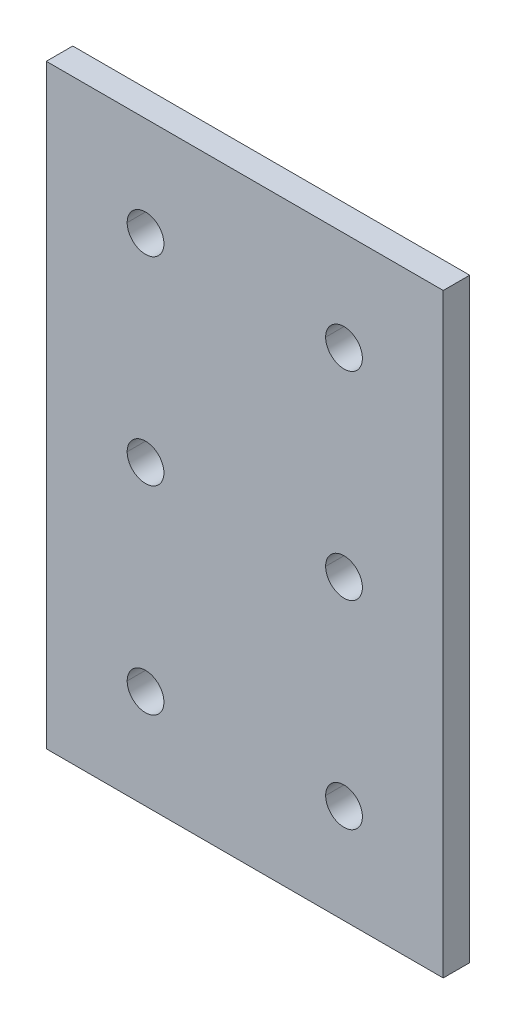
ISO-10303-21;
HEADER;
FILE_DESCRIPTION(('STEP AP214'),'2;1');
FILE_NAME('part.step','',(''),(''),'','','');
FILE_SCHEMA(('AUTOMOTIVE_DESIGN { 1 0 10303 214 1 1 1 1 }'));
ENDSEC;
DATA;
#1=APPLICATION_CONTEXT('core data for automotive mechanical design processes');
#2=APPLICATION_PROTOCOL_DEFINITION('international standard','automotive_design',2000,#1);
#3=PRODUCT_CONTEXT('',#1,'mechanical');
#4=PRODUCT('Part','Part','',(#3));
#5=PRODUCT_RELATED_PRODUCT_CATEGORY('part','',(#4));
#6=PRODUCT_DEFINITION_FORMATION('','',#4);
#7=PRODUCT_DEFINITION_CONTEXT('part definition',#1,'design');
#8=PRODUCT_DEFINITION('design','',#6,#7);
#9=PRODUCT_DEFINITION_SHAPE('','',#8);
#10=(LENGTH_UNIT() NAMED_UNIT(*) SI_UNIT(.MILLI.,.METRE.));
#11=(NAMED_UNIT(*) PLANE_ANGLE_UNIT() SI_UNIT($,.RADIAN.));
#12=(NAMED_UNIT(*) SI_UNIT($,.STERADIAN.) SOLID_ANGLE_UNIT());
#13=UNCERTAINTY_MEASURE_WITH_UNIT(LENGTH_MEASURE(1.E-05),#10,'distance_accuracy_value','');
#14=(GEOMETRIC_REPRESENTATION_CONTEXT(3) GLOBAL_UNCERTAINTY_ASSIGNED_CONTEXT((#13)) GLOBAL_UNIT_ASSIGNED_CONTEXT((#10,
#11,#12)) REPRESENTATION_CONTEXT('',''));
#15=CARTESIAN_POINT('',(0.,0.,0.));
#16=DIRECTION('',(0.,0.,1.));
#17=DIRECTION('',(1.,0.,0.));
#18=AXIS2_PLACEMENT_3D('',#15,#16,#17);
#19=CARTESIAN_POINT('',(45.,135.,6.));
#20=DIRECTION('',(0.,-1.,0.));
#21=DIRECTION('',(0.,0.,-1.));
#22=AXIS2_PLACEMENT_3D('',#19,#20,#21);
#23=PLANE('',#22);
#24=DIRECTION('',(-1.,0.,0.));
#25=VECTOR('',#24,1.);
#26=CARTESIAN_POINT('',(45.,135.,0.));
#27=LINE('',#26,#25);
#28=CARTESIAN_POINT('',(45.,135.,0.));
#29=VERTEX_POINT('',#28);
#30=CARTESIAN_POINT('',(-45.,135.,0.));
#31=VERTEX_POINT('',#30);
#32=EDGE_CURVE('E11',#29,#31,#27,.T.);
#33=ORIENTED_EDGE('',*,*,#32,.T.);
#34=DIRECTION('',(0.,0.,-1.));
#35=VECTOR('',#34,1.);
#36=CARTESIAN_POINT('',(-45.,135.,6.));
#37=LINE('',#36,#35);
#38=CARTESIAN_POINT('',(-45.,135.,6.));
#39=VERTEX_POINT('',#38);
#40=EDGE_CURVE('E25',#39,#31,#37,.T.);
#41=ORIENTED_EDGE('',*,*,#40,.F.);
#42=DIRECTION('',(-1.,0.,0.));
#43=VECTOR('',#42,1.);
#44=CARTESIAN_POINT('',(45.,135.,6.));
#45=LINE('',#44,#43);
#46=CARTESIAN_POINT('',(45.,135.,6.));
#47=VERTEX_POINT('',#46);
#48=EDGE_CURVE('E305',#47,#39,#45,.T.);
#49=ORIENTED_EDGE('',*,*,#48,.F.);
#50=DIRECTION('',(0.,0.,-1.));
#51=VECTOR('',#50,1.);
#52=CARTESIAN_POINT('',(45.,135.,6.));
#53=LINE('',#52,#51);
#54=EDGE_CURVE('E301',#47,#29,#53,.T.);
#55=ORIENTED_EDGE('',*,*,#54,.T.);
#56=EDGE_LOOP('',(#33,#41,#49,#55));
#57=FACE_BOUND('',#56,.T.);
#58=ADVANCED_FACE('F17',(#57),#23,.F.);
#59=CARTESIAN_POINT('',(45.,0.,6.));
#60=DIRECTION('',(-1.,0.,0.));
#61=DIRECTION('',(0.,0.,1.));
#62=AXIS2_PLACEMENT_3D('',#59,#60,#61);
#63=PLANE('',#62);
#64=DIRECTION('',(0.,1.,0.));
#65=VECTOR('',#64,1.);
#66=CARTESIAN_POINT('',(45.,0.,0.));
#67=LINE('',#66,#65);
#68=CARTESIAN_POINT('',(45.,0.,0.));
#69=VERTEX_POINT('',#68);
#70=EDGE_CURVE('E296',#69,#29,#67,.T.);
#71=ORIENTED_EDGE('',*,*,#70,.T.);
#72=ORIENTED_EDGE('',*,*,#54,.F.);
#73=DIRECTION('',(0.,1.,0.));
#74=VECTOR('',#73,1.);
#75=CARTESIAN_POINT('',(45.,0.,6.));
#76=LINE('',#75,#74);
#77=CARTESIAN_POINT('',(45.,0.,6.));
#78=VERTEX_POINT('',#77);
#79=EDGE_CURVE('E291',#78,#47,#76,.T.);
#80=ORIENTED_EDGE('',*,*,#79,.F.);
#81=DIRECTION('',(0.,0.,-1.));
#82=VECTOR('',#81,1.);
#83=CARTESIAN_POINT('',(45.,0.,6.));
#84=LINE('',#83,#82);
#85=EDGE_CURVE('E287',#78,#69,#84,.T.);
#86=ORIENTED_EDGE('',*,*,#85,.T.);
#87=EDGE_LOOP('',(#71,#72,#80,#86));
#88=FACE_BOUND('',#87,.T.);
#89=ADVANCED_FACE('F323',(#88),#63,.F.);
#90=CARTESIAN_POINT('',(-45.,0.,6.));
#91=DIRECTION('',(0.,1.,0.));
#92=DIRECTION('',(0.,0.,1.));
#93=AXIS2_PLACEMENT_3D('',#90,#91,#92);
#94=PLANE('',#93);
#95=DIRECTION('',(1.,0.,0.));
#96=VECTOR('',#95,1.);
#97=CARTESIAN_POINT('',(-45.,0.,0.));
#98=LINE('',#97,#96);
#99=CARTESIAN_POINT('',(-45.,0.,0.));
#100=VERTEX_POINT('',#99);
#101=EDGE_CURVE('E282',#100,#69,#98,.T.);
#102=ORIENTED_EDGE('',*,*,#101,.T.);
#103=ORIENTED_EDGE('',*,*,#85,.F.);
#104=DIRECTION('',(1.,0.,0.));
#105=VECTOR('',#104,1.);
#106=CARTESIAN_POINT('',(-45.,0.,6.));
#107=LINE('',#106,#105);
#108=CARTESIAN_POINT('',(-45.,0.,6.));
#109=VERTEX_POINT('',#108);
#110=EDGE_CURVE('E277',#109,#78,#107,.T.);
#111=ORIENTED_EDGE('',*,*,#110,.F.);
#112=DIRECTION('',(0.,0.,-1.));
#113=VECTOR('',#112,1.);
#114=CARTESIAN_POINT('',(-45.,0.,6.));
#115=LINE('',#114,#113);
#116=EDGE_CURVE('E273',#109,#100,#115,.T.);
#117=ORIENTED_EDGE('',*,*,#116,.T.);
#118=EDGE_LOOP('',(#102,#103,#111,#117));
#119=FACE_BOUND('',#118,.T.);
#120=ADVANCED_FACE('F327',(#119),#94,.F.);
#121=CARTESIAN_POINT('',(-45.,135.,6.));
#122=DIRECTION('',(1.,0.,0.));
#123=DIRECTION('',(0.,0.,-1.));
#124=AXIS2_PLACEMENT_3D('',#121,#122,#123);
#125=PLANE('',#124);
#126=DIRECTION('',(0.,-1.,0.));
#127=VECTOR('',#126,1.);
#128=CARTESIAN_POINT('',(-45.,135.,0.));
#129=LINE('',#128,#127);
#130=EDGE_CURVE('E268',#31,#100,#129,.T.);
#131=ORIENTED_EDGE('',*,*,#130,.T.);
#132=ORIENTED_EDGE('',*,*,#116,.F.);
#133=DIRECTION('',(0.,-1.,0.));
#134=VECTOR('',#133,1.);
#135=CARTESIAN_POINT('',(-45.,135.,6.));
#136=LINE('',#135,#134);
#137=EDGE_CURVE('E263',#39,#109,#136,.T.);
#138=ORIENTED_EDGE('',*,*,#137,.F.);
#139=ORIENTED_EDGE('',*,*,#40,.T.);
#140=EDGE_LOOP('',(#131,#132,#138,#139));
#141=FACE_BOUND('',#140,.T.);
#142=ADVANCED_FACE('F315',(#141),#125,.F.);
#143=CARTESIAN_POINT('',(0.,0.,6.));
#144=DIRECTION('',(0.,0.,1.));
#145=DIRECTION('',(1.,0.,0.));
#146=AXIS2_PLACEMENT_3D('',#143,#144,#145);
#147=PLANE('',#146);
#148=CARTESIAN_POINT('',(-22.5,112.5,6.));
#149=DIRECTION('',(0.,0.,1.));
#150=DIRECTION('',(1.,0.,0.));
#151=AXIS2_PLACEMENT_3D('',#148,#149,#150);
#152=CIRCLE('',#151,4.165);
#153=CARTESIAN_POINT('',(-26.665,112.5,6.));
#154=VERTEX_POINT('',#153);
#155=CARTESIAN_POINT('',(-18.335,112.5,6.));
#156=VERTEX_POINT('',#155);
#157=EDGE_CURVE('E258',#154,#156,#152,.T.);
#158=ORIENTED_EDGE('',*,*,#157,.F.);
#159=CARTESIAN_POINT('',(-22.5,112.5,6.));
#160=DIRECTION('',(0.,0.,1.));
#161=DIRECTION('',(1.,0.,0.));
#162=AXIS2_PLACEMENT_3D('',#159,#160,#161);
#163=CIRCLE('',#162,4.165);
#164=EDGE_CURVE('E253',#156,#154,#163,.T.);
#165=ORIENTED_EDGE('',*,*,#164,.F.);
#166=EDGE_LOOP('',(#158,#165));
#167=FACE_BOUND('',#166,.T.);
#168=CARTESIAN_POINT('',(-22.5,67.5,6.));
#169=DIRECTION('',(0.,0.,1.));
#170=DIRECTION('',(1.,0.,0.));
#171=AXIS2_PLACEMENT_3D('',#168,#169,#170);
#172=CIRCLE('',#171,4.165);
#173=CARTESIAN_POINT('',(-26.665,67.5,6.));
#174=VERTEX_POINT('',#173);
#175=CARTESIAN_POINT('',(-18.335,67.5,6.));
#176=VERTEX_POINT('',#175);
#177=EDGE_CURVE('E248',#174,#176,#172,.T.);
#178=ORIENTED_EDGE('',*,*,#177,.F.);
#179=CARTESIAN_POINT('',(-22.5,67.5,6.));
#180=DIRECTION('',(0.,0.,1.));
#181=DIRECTION('',(1.,0.,0.));
#182=AXIS2_PLACEMENT_3D('',#179,#180,#181);
#183=CIRCLE('',#182,4.165);
#184=EDGE_CURVE('E243',#176,#174,#183,.T.);
#185=ORIENTED_EDGE('',*,*,#184,.F.);
#186=EDGE_LOOP('',(#178,#185));
#187=FACE_BOUND('',#186,.T.);
#188=CARTESIAN_POINT('',(-22.5,22.5,6.));
#189=DIRECTION('',(0.,0.,1.));
#190=DIRECTION('',(1.,0.,0.));
#191=AXIS2_PLACEMENT_3D('',#188,#189,#190);
#192=CIRCLE('',#191,4.165);
#193=CARTESIAN_POINT('',(-26.665,22.5,6.));
#194=VERTEX_POINT('',#193);
#195=CARTESIAN_POINT('',(-18.335,22.5,6.));
#196=VERTEX_POINT('',#195);
#197=EDGE_CURVE('E238',#194,#196,#192,.T.);
#198=ORIENTED_EDGE('',*,*,#197,.F.);
#199=CARTESIAN_POINT('',(-22.5,22.5,6.));
#200=DIRECTION('',(0.,0.,1.));
#201=DIRECTION('',(1.,0.,0.));
#202=AXIS2_PLACEMENT_3D('',#199,#200,#201);
#203=CIRCLE('',#202,4.165);
#204=EDGE_CURVE('E233',#196,#194,#203,.T.);
#205=ORIENTED_EDGE('',*,*,#204,.F.);
#206=EDGE_LOOP('',(#198,#205));
#207=FACE_BOUND('',#206,.T.);
#208=CARTESIAN_POINT('',(22.5,112.5,6.));
#209=DIRECTION('',(0.,0.,1.));
#210=DIRECTION('',(1.,0.,0.));
#211=AXIS2_PLACEMENT_3D('',#208,#209,#210);
#212=CIRCLE('',#211,4.165);
#213=CARTESIAN_POINT('',(18.335,112.5,6.));
#214=VERTEX_POINT('',#213);
#215=CARTESIAN_POINT('',(26.665,112.5,6.));
#216=VERTEX_POINT('',#215);
#217=EDGE_CURVE('E228',#214,#216,#212,.T.);
#218=ORIENTED_EDGE('',*,*,#217,.F.);
#219=CARTESIAN_POINT('',(22.5,112.5,6.));
#220=DIRECTION('',(0.,0.,1.));
#221=DIRECTION('',(1.,0.,0.));
#222=AXIS2_PLACEMENT_3D('',#219,#220,#221);
#223=CIRCLE('',#222,4.165);
#224=EDGE_CURVE('E223',#216,#214,#223,.T.);
#225=ORIENTED_EDGE('',*,*,#224,.F.);
#226=EDGE_LOOP('',(#218,#225));
#227=FACE_BOUND('',#226,.T.);
#228=CARTESIAN_POINT('',(22.5,67.5,6.));
#229=DIRECTION('',(0.,0.,1.));
#230=DIRECTION('',(1.,0.,0.));
#231=AXIS2_PLACEMENT_3D('',#228,#229,#230);
#232=CIRCLE('',#231,4.165);
#233=CARTESIAN_POINT('',(18.335,67.5,6.));
#234=VERTEX_POINT('',#233);
#235=CARTESIAN_POINT('',(26.665,67.5,6.));
#236=VERTEX_POINT('',#235);
#237=EDGE_CURVE('E146',#234,#236,#232,.T.);
#238=ORIENTED_EDGE('',*,*,#237,.F.);
#239=CARTESIAN_POINT('',(22.5,67.5,6.));
#240=DIRECTION('',(0.,0.,1.));
#241=DIRECTION('',(1.,0.,0.));
#242=AXIS2_PLACEMENT_3D('',#239,#240,#241);
#243=CIRCLE('',#242,4.165);
#244=EDGE_CURVE('E216',#236,#234,#243,.T.);
#245=ORIENTED_EDGE('',*,*,#244,.F.);
#246=EDGE_LOOP('',(#238,#245));
#247=FACE_BOUND('',#246,.T.);
#248=CARTESIAN_POINT('',(22.5,22.5,6.));
#249=DIRECTION('',(0.,0.,1.));
#250=DIRECTION('',(1.,0.,0.));
#251=AXIS2_PLACEMENT_3D('',#248,#249,#250);
#252=CIRCLE('',#251,4.165);
#253=CARTESIAN_POINT('',(18.335,22.5,6.));
#254=VERTEX_POINT('',#253);
#255=CARTESIAN_POINT('',(26.665,22.5,6.));
#256=VERTEX_POINT('',#255);
#257=EDGE_CURVE('E211',#254,#256,#252,.T.);
#258=ORIENTED_EDGE('',*,*,#257,.F.);
#259=CARTESIAN_POINT('',(22.5,22.5,6.));
#260=DIRECTION('',(0.,0.,1.));
#261=DIRECTION('',(1.,0.,0.));
#262=AXIS2_PLACEMENT_3D('',#259,#260,#261);
#263=CIRCLE('',#262,4.165);
#264=EDGE_CURVE('E206',#256,#254,#263,.T.);
#265=ORIENTED_EDGE('',*,*,#264,.F.);
#266=EDGE_LOOP('',(#258,#265));
#267=FACE_BOUND('',#266,.T.);
#268=ORIENTED_EDGE('',*,*,#48,.T.);
#269=ORIENTED_EDGE('',*,*,#137,.T.);
#270=ORIENTED_EDGE('',*,*,#110,.T.);
#271=ORIENTED_EDGE('',*,*,#79,.T.);
#272=EDGE_LOOP('',(#268,#269,#270,#271));
#273=FACE_BOUND('',#272,.T.);
#274=ADVANCED_FACE('F319',(#167,#187,#207,#227,#247,#267,#273),#147,.T.);
#275=CARTESIAN_POINT('',(22.5,22.5,6.));
#276=DIRECTION('',(0.,0.,-1.));
#277=DIRECTION('',(0.,-1.,0.));
#278=AXIS2_PLACEMENT_3D('',#275,#276,#277);
#279=CYLINDRICAL_SURFACE('',#278,4.165);
#280=DIRECTION('',(0.,0.,-1.));
#281=VECTOR('',#280,1.);
#282=CARTESIAN_POINT('',(26.665,22.5,6.));
#283=LINE('',#282,#281);
#284=CARTESIAN_POINT('',(26.665,22.5,0.));
#285=VERTEX_POINT('',#284);
#286=EDGE_CURVE('E201',#256,#285,#283,.T.);
#287=ORIENTED_EDGE('',*,*,#286,.F.);
#288=ORIENTED_EDGE('',*,*,#264,.T.);
#289=DIRECTION('',(0.,0.,-1.));
#290=VECTOR('',#289,1.);
#291=CARTESIAN_POINT('',(18.335,22.5,6.));
#292=LINE('',#291,#290);
#293=CARTESIAN_POINT('',(18.335,22.5,0.));
#294=VERTEX_POINT('',#293);
#295=EDGE_CURVE('E197',#254,#294,#292,.T.);
#296=ORIENTED_EDGE('',*,*,#295,.T.);
#297=CARTESIAN_POINT('',(22.5,22.5,0.));
#298=DIRECTION('',(0.,0.,1.));
#299=DIRECTION('',(1.,0.,0.));
#300=AXIS2_PLACEMENT_3D('',#297,#298,#299);
#301=CIRCLE('',#300,4.165);
#302=EDGE_CURVE('E192',#285,#294,#301,.T.);
#303=ORIENTED_EDGE('',*,*,#302,.F.);
#304=EDGE_LOOP('',(#287,#288,#296,#303));
#305=FACE_BOUND('',#304,.T.);
#306=ADVANCED_FACE('F370',(#305),#279,.F.);
#307=CARTESIAN_POINT('',(0.,0.,0.));
#308=DIRECTION('',(0.,0.,1.));
#309=DIRECTION('',(1.,0.,0.));
#310=AXIS2_PLACEMENT_3D('',#307,#308,#309);
#311=PLANE('',#310);
#312=CARTESIAN_POINT('',(-22.5,112.5,0.));
#313=DIRECTION('',(0.,0.,1.));
#314=DIRECTION('',(1.,0.,0.));
#315=AXIS2_PLACEMENT_3D('',#312,#313,#314);
#316=CIRCLE('',#315,4.165);
#317=CARTESIAN_POINT('',(-18.335,112.5,0.));
#318=VERTEX_POINT('',#317);
#319=CARTESIAN_POINT('',(-26.665,112.5,0.));
#320=VERTEX_POINT('',#319);
#321=EDGE_CURVE('E188',#318,#320,#316,.T.);
#322=ORIENTED_EDGE('',*,*,#321,.T.);
#323=CARTESIAN_POINT('',(-22.5,112.5,0.));
#324=DIRECTION('',(0.,0.,1.));
#325=DIRECTION('',(1.,0.,0.));
#326=AXIS2_PLACEMENT_3D('',#323,#324,#325);
#327=CIRCLE('',#326,4.165);
#328=EDGE_CURVE('E184',#320,#318,#327,.T.);
#329=ORIENTED_EDGE('',*,*,#328,.T.);
#330=EDGE_LOOP('',(#322,#329));
#331=FACE_BOUND('',#330,.T.);
#332=CARTESIAN_POINT('',(-22.5,67.5,0.));
#333=DIRECTION('',(0.,0.,1.));
#334=DIRECTION('',(1.,0.,0.));
#335=AXIS2_PLACEMENT_3D('',#332,#333,#334);
#336=CIRCLE('',#335,4.165);
#337=CARTESIAN_POINT('',(-18.335,67.5,0.));
#338=VERTEX_POINT('',#337);
#339=CARTESIAN_POINT('',(-26.665,67.5,0.));
#340=VERTEX_POINT('',#339);
#341=EDGE_CURVE('E180',#338,#340,#336,.T.);
#342=ORIENTED_EDGE('',*,*,#341,.T.);
#343=CARTESIAN_POINT('',(-22.5,67.5,0.));
#344=DIRECTION('',(0.,0.,1.));
#345=DIRECTION('',(1.,0.,0.));
#346=AXIS2_PLACEMENT_3D('',#343,#344,#345);
#347=CIRCLE('',#346,4.165);
#348=EDGE_CURVE('E176',#340,#338,#347,.T.);
#349=ORIENTED_EDGE('',*,*,#348,.T.);
#350=EDGE_LOOP('',(#342,#349));
#351=FACE_BOUND('',#350,.T.);
#352=CARTESIAN_POINT('',(-22.5,22.5,0.));
#353=DIRECTION('',(0.,0.,1.));
#354=DIRECTION('',(1.,0.,0.));
#355=AXIS2_PLACEMENT_3D('',#352,#353,#354);
#356=CIRCLE('',#355,4.165);
#357=CARTESIAN_POINT('',(-18.335,22.5,0.));
#358=VERTEX_POINT('',#357);
#359=CARTESIAN_POINT('',(-26.665,22.5,0.));
#360=VERTEX_POINT('',#359);
#361=EDGE_CURVE('E172',#358,#360,#356,.T.);
#362=ORIENTED_EDGE('',*,*,#361,.T.);
#363=CARTESIAN_POINT('',(-22.5,22.5,0.));
#364=DIRECTION('',(0.,0.,1.));
#365=DIRECTION('',(1.,0.,0.));
#366=AXIS2_PLACEMENT_3D('',#363,#364,#365);
#367=CIRCLE('',#366,4.165);
#368=EDGE_CURVE('E168',#360,#358,#367,.T.);
#369=ORIENTED_EDGE('',*,*,#368,.T.);
#370=EDGE_LOOP('',(#362,#369));
#371=FACE_BOUND('',#370,.T.);
#372=CARTESIAN_POINT('',(22.5,112.5,0.));
#373=DIRECTION('',(0.,0.,1.));
#374=DIRECTION('',(1.,0.,0.));
#375=AXIS2_PLACEMENT_3D('',#372,#373,#374);
#376=CIRCLE('',#375,4.165);
#377=CARTESIAN_POINT('',(26.665,112.5,0.));
#378=VERTEX_POINT('',#377);
#379=CARTESIAN_POINT('',(18.335,112.5,0.));
#380=VERTEX_POINT('',#379);
#381=EDGE_CURVE('E164',#378,#380,#376,.T.);
#382=ORIENTED_EDGE('',*,*,#381,.T.);
#383=CARTESIAN_POINT('',(22.5,112.5,0.));
#384=DIRECTION('',(0.,0.,1.));
#385=DIRECTION('',(1.,0.,0.));
#386=AXIS2_PLACEMENT_3D('',#383,#384,#385);
#387=CIRCLE('',#386,4.165);
#388=EDGE_CURVE('E143',#380,#378,#387,.T.);
#389=ORIENTED_EDGE('',*,*,#388,.T.);
#390=EDGE_LOOP('',(#382,#389));
#391=FACE_BOUND('',#390,.T.);
#392=CARTESIAN_POINT('',(22.5,67.5,0.));
#393=DIRECTION('',(0.,0.,1.));
#394=DIRECTION('',(1.,0.,0.));
#395=AXIS2_PLACEMENT_3D('',#392,#393,#394);
#396=CIRCLE('',#395,4.165);
#397=CARTESIAN_POINT('',(26.665,67.5,0.));
#398=VERTEX_POINT('',#397);
#399=CARTESIAN_POINT('',(18.335,67.5,0.));
#400=VERTEX_POINT('',#399);
#401=EDGE_CURVE('E129',#398,#400,#396,.T.);
#402=ORIENTED_EDGE('',*,*,#401,.T.);
#403=CARTESIAN_POINT('',(22.5,67.5,0.));
#404=DIRECTION('',(0.,0.,1.));
#405=DIRECTION('',(1.,0.,0.));
#406=AXIS2_PLACEMENT_3D('',#403,#404,#405);
#407=CIRCLE('',#406,4.165);
#408=EDGE_CURVE('E125',#400,#398,#407,.T.);
#409=ORIENTED_EDGE('',*,*,#408,.T.);
#410=EDGE_LOOP('',(#402,#409));
#411=FACE_BOUND('',#410,.T.);
#412=ORIENTED_EDGE('',*,*,#302,.T.);
#413=CARTESIAN_POINT('',(22.5,22.5,0.));
#414=DIRECTION('',(0.,0.,1.));
#415=DIRECTION('',(1.,0.,0.));
#416=AXIS2_PLACEMENT_3D('',#413,#414,#415);
#417=CIRCLE('',#416,4.165);
#418=EDGE_CURVE('E134',#294,#285,#417,.T.);
#419=ORIENTED_EDGE('',*,*,#418,.T.);
#420=EDGE_LOOP('',(#412,#419));
#421=FACE_BOUND('',#420,.T.);
#422=ORIENTED_EDGE('',*,*,#32,.F.);
#423=ORIENTED_EDGE('',*,*,#70,.F.);
#424=ORIENTED_EDGE('',*,*,#101,.F.);
#425=ORIENTED_EDGE('',*,*,#130,.F.);
#426=EDGE_LOOP('',(#422,#423,#424,#425));
#427=FACE_BOUND('',#426,.T.);
#428=ADVANCED_FACE('F127',(#331,#351,#371,#391,#411,#421,#427),#311,.F.);
#429=CARTESIAN_POINT('',(22.5,22.5,6.));
#430=DIRECTION('',(0.,0.,-1.));
#431=DIRECTION('',(0.,1.,0.));
#432=AXIS2_PLACEMENT_3D('',#429,#430,#431);
#433=CYLINDRICAL_SURFACE('',#432,4.165);
#434=ORIENTED_EDGE('',*,*,#286,.T.);
#435=ORIENTED_EDGE('',*,*,#418,.F.);
#436=ORIENTED_EDGE('',*,*,#295,.F.);
#437=ORIENTED_EDGE('',*,*,#257,.T.);
#438=EDGE_LOOP('',(#434,#435,#436,#437));
#439=FACE_BOUND('',#438,.T.);
#440=ADVANCED_FACE('F391',(#439),#433,.F.);
#441=CARTESIAN_POINT('',(22.5,67.5,6.));
#442=DIRECTION('',(0.,0.,-1.));
#443=DIRECTION('',(0.,1.,0.));
#444=AXIS2_PLACEMENT_3D('',#441,#442,#443);
#445=CYLINDRICAL_SURFACE('',#444,4.165);
#446=DIRECTION('',(0.,0.,-1.));
#447=VECTOR('',#446,1.);
#448=CARTESIAN_POINT('',(26.665,67.5,6.));
#449=LINE('',#448,#447);
#450=EDGE_CURVE('E140',#236,#398,#449,.T.);
#451=ORIENTED_EDGE('',*,*,#450,.T.);
#452=ORIENTED_EDGE('',*,*,#408,.F.);
#453=DIRECTION('',(0.,0.,-1.));
#454=VECTOR('',#453,1.);
#455=CARTESIAN_POINT('',(18.335,67.5,6.));
#456=LINE('',#455,#454);
#457=EDGE_CURVE('E142',#234,#400,#456,.T.);
#458=ORIENTED_EDGE('',*,*,#457,.F.);
#459=ORIENTED_EDGE('',*,*,#237,.T.);
#460=EDGE_LOOP('',(#451,#452,#458,#459));
#461=FACE_BOUND('',#460,.T.);
#462=ADVANCED_FACE('F145',(#461),#445,.F.);
#463=CARTESIAN_POINT('',(22.5,67.5,6.));
#464=DIRECTION('',(0.,0.,-1.));
#465=DIRECTION('',(0.,-1.,0.));
#466=AXIS2_PLACEMENT_3D('',#463,#464,#465);
#467=CYLINDRICAL_SURFACE('',#466,4.165);
#468=ORIENTED_EDGE('',*,*,#450,.F.);
#469=ORIENTED_EDGE('',*,*,#244,.T.);
#470=ORIENTED_EDGE('',*,*,#457,.T.);
#471=ORIENTED_EDGE('',*,*,#401,.F.);
#472=EDGE_LOOP('',(#468,#469,#470,#471));
#473=FACE_BOUND('',#472,.T.);
#474=ADVANCED_FACE('F138',(#473),#467,.F.);
#475=CARTESIAN_POINT('',(22.5,112.5,6.));
#476=DIRECTION('',(0.,0.,-1.));
#477=DIRECTION('',(0.,1.,0.));
#478=AXIS2_PLACEMENT_3D('',#475,#476,#477);
#479=CYLINDRICAL_SURFACE('',#478,4.165);
#480=DIRECTION('',(0.,0.,-1.));
#481=VECTOR('',#480,1.);
#482=CARTESIAN_POINT('',(26.665,112.5,6.));
#483=LINE('',#482,#481);
#484=EDGE_CURVE('E150',#216,#378,#483,.T.);
#485=ORIENTED_EDGE('',*,*,#484,.T.);
#486=ORIENTED_EDGE('',*,*,#388,.F.);
#487=DIRECTION('',(0.,0.,-1.));
#488=VECTOR('',#487,1.);
#489=CARTESIAN_POINT('',(18.335,112.5,6.));
#490=LINE('',#489,#488);
#491=EDGE_CURVE('E563',#214,#380,#490,.T.);
#492=ORIENTED_EDGE('',*,*,#491,.F.);
#493=ORIENTED_EDGE('',*,*,#217,.T.);
#494=EDGE_LOOP('',(#485,#486,#492,#493));
#495=FACE_BOUND('',#494,.T.);
#496=ADVANCED_FACE('F421',(#495),#479,.F.);
#497=CARTESIAN_POINT('',(22.5,112.5,6.));
#498=DIRECTION('',(0.,0.,-1.));
#499=DIRECTION('',(0.,-1.,0.));
#500=AXIS2_PLACEMENT_3D('',#497,#498,#499);
#501=CYLINDRICAL_SURFACE('',#500,4.165);
#502=ORIENTED_EDGE('',*,*,#484,.F.);
#503=ORIENTED_EDGE('',*,*,#224,.T.);
#504=ORIENTED_EDGE('',*,*,#491,.T.);
#505=ORIENTED_EDGE('',*,*,#381,.F.);
#506=EDGE_LOOP('',(#502,#503,#504,#505));
#507=FACE_BOUND('',#506,.T.);
#508=ADVANCED_FACE('F431',(#507),#501,.F.);
#509=CARTESIAN_POINT('',(-22.5,22.5,6.));
#510=DIRECTION('',(0.,0.,-1.));
#511=DIRECTION('',(0.,1.,0.));
#512=AXIS2_PLACEMENT_3D('',#509,#510,#511);
#513=CYLINDRICAL_SURFACE('',#512,4.165);
#514=DIRECTION('',(0.,0.,-1.));
#515=VECTOR('',#514,1.);
#516=CARTESIAN_POINT('',(-18.335,22.5,6.));
#517=LINE('',#516,#515);
#518=EDGE_CURVE('E565',#196,#358,#517,.T.);
#519=ORIENTED_EDGE('',*,*,#518,.T.);
#520=ORIENTED_EDGE('',*,*,#368,.F.);
#521=DIRECTION('',(0.,0.,-1.));
#522=VECTOR('',#521,1.);
#523=CARTESIAN_POINT('',(-26.665,22.5,6.));
#524=LINE('',#523,#522);
#525=EDGE_CURVE('E577',#194,#360,#524,.T.);
#526=ORIENTED_EDGE('',*,*,#525,.F.);
#527=ORIENTED_EDGE('',*,*,#197,.T.);
#528=EDGE_LOOP('',(#519,#520,#526,#527));
#529=FACE_BOUND('',#528,.T.);
#530=ADVANCED_FACE('F442',(#529),#513,.F.);
#531=CARTESIAN_POINT('',(-22.5,22.5,6.));
#532=DIRECTION('',(0.,0.,-1.));
#533=DIRECTION('',(0.,-1.,0.));
#534=AXIS2_PLACEMENT_3D('',#531,#532,#533);
#535=CYLINDRICAL_SURFACE('',#534,4.165);
#536=ORIENTED_EDGE('',*,*,#518,.F.);
#537=ORIENTED_EDGE('',*,*,#204,.T.);
#538=ORIENTED_EDGE('',*,*,#525,.T.);
#539=ORIENTED_EDGE('',*,*,#361,.F.);
#540=EDGE_LOOP('',(#536,#537,#538,#539));
#541=FACE_BOUND('',#540,.T.);
#542=ADVANCED_FACE('F453',(#541),#535,.F.);
#543=CARTESIAN_POINT('',(-22.5,67.5,6.));
#544=DIRECTION('',(0.,0.,-1.));
#545=DIRECTION('',(0.,1.,0.));
#546=AXIS2_PLACEMENT_3D('',#543,#544,#545);
#547=CYLINDRICAL_SURFACE('',#546,4.165);
#548=DIRECTION('',(0.,0.,-1.));
#549=VECTOR('',#548,1.);
#550=CARTESIAN_POINT('',(-18.335,67.5,6.));
#551=LINE('',#550,#549);
#552=EDGE_CURVE('E582',#176,#338,#551,.T.);
#553=ORIENTED_EDGE('',*,*,#552,.T.);
#554=ORIENTED_EDGE('',*,*,#348,.F.);
#555=DIRECTION('',(0.,0.,-1.));
#556=VECTOR('',#555,1.);
#557=CARTESIAN_POINT('',(-26.665,67.5,6.));
#558=LINE('',#557,#556);
#559=EDGE_CURVE('E544',#174,#340,#558,.T.);
#560=ORIENTED_EDGE('',*,*,#559,.F.);
#561=ORIENTED_EDGE('',*,*,#177,.T.);
#562=EDGE_LOOP('',(#553,#554,#560,#561));
#563=FACE_BOUND('',#562,.T.);
#564=ADVANCED_FACE('F464',(#563),#547,.F.);
#565=CARTESIAN_POINT('',(-22.5,67.5,6.));
#566=DIRECTION('',(0.,0.,-1.));
#567=DIRECTION('',(0.,-1.,0.));
#568=AXIS2_PLACEMENT_3D('',#565,#566,#567);
#569=CYLINDRICAL_SURFACE('',#568,4.165);
#570=ORIENTED_EDGE('',*,*,#552,.F.);
#571=ORIENTED_EDGE('',*,*,#184,.T.);
#572=ORIENTED_EDGE('',*,*,#559,.T.);
#573=ORIENTED_EDGE('',*,*,#341,.F.);
#574=EDGE_LOOP('',(#570,#571,#572,#573));
#575=FACE_BOUND('',#574,.T.);
#576=ADVANCED_FACE('F475',(#575),#569,.F.);
#577=CARTESIAN_POINT('',(-22.5,112.5,6.));
#578=DIRECTION('',(0.,0.,-1.));
#579=DIRECTION('',(0.,1.,0.));
#580=AXIS2_PLACEMENT_3D('',#577,#578,#579);
#581=CYLINDRICAL_SURFACE('',#580,4.165);
#582=DIRECTION('',(0.,0.,-1.));
#583=VECTOR('',#582,1.);
#584=CARTESIAN_POINT('',(-18.335,112.5,6.));
#585=LINE('',#584,#583);
#586=EDGE_CURVE('E541',#156,#318,#585,.T.);
#587=ORIENTED_EDGE('',*,*,#586,.T.);
#588=ORIENTED_EDGE('',*,*,#328,.F.);
#589=DIRECTION('',(0.,0.,-1.));
#590=VECTOR('',#589,1.);
#591=CARTESIAN_POINT('',(-26.665,112.5,6.));
#592=LINE('',#591,#590);
#593=EDGE_CURVE('E545',#154,#320,#592,.T.);
#594=ORIENTED_EDGE('',*,*,#593,.F.);
#595=ORIENTED_EDGE('',*,*,#157,.T.);
#596=EDGE_LOOP('',(#587,#588,#594,#595));
#597=FACE_BOUND('',#596,.T.);
#598=ADVANCED_FACE('F486',(#597),#581,.F.);
#599=CARTESIAN_POINT('',(-22.5,112.5,6.));
#600=DIRECTION('',(0.,0.,-1.));
#601=DIRECTION('',(0.,-1.,0.));
#602=AXIS2_PLACEMENT_3D('',#599,#600,#601);
#603=CYLINDRICAL_SURFACE('',#602,4.165);
#604=ORIENTED_EDGE('',*,*,#586,.F.);
#605=ORIENTED_EDGE('',*,*,#164,.T.);
#606=ORIENTED_EDGE('',*,*,#593,.T.);
#607=ORIENTED_EDGE('',*,*,#321,.F.);
#608=EDGE_LOOP('',(#604,#605,#606,#607));
#609=FACE_BOUND('',#608,.T.);
#610=ADVANCED_FACE('F497',(#609),#603,.F.);
#611=CLOSED_SHELL('',(#58,#89,#120,#142,#274,#306,#428,#440,#462,#474,#496,#508,#530,#542,#564,
#576,#598,#610));
#612=MANIFOLD_SOLID_BREP('B1',#611);
#613=ADVANCED_BREP_SHAPE_REPRESENTATION('',(#18,#612),#14);
#614=SHAPE_DEFINITION_REPRESENTATION(#9,#613);
ENDSEC;
END-ISO-10303-21;
